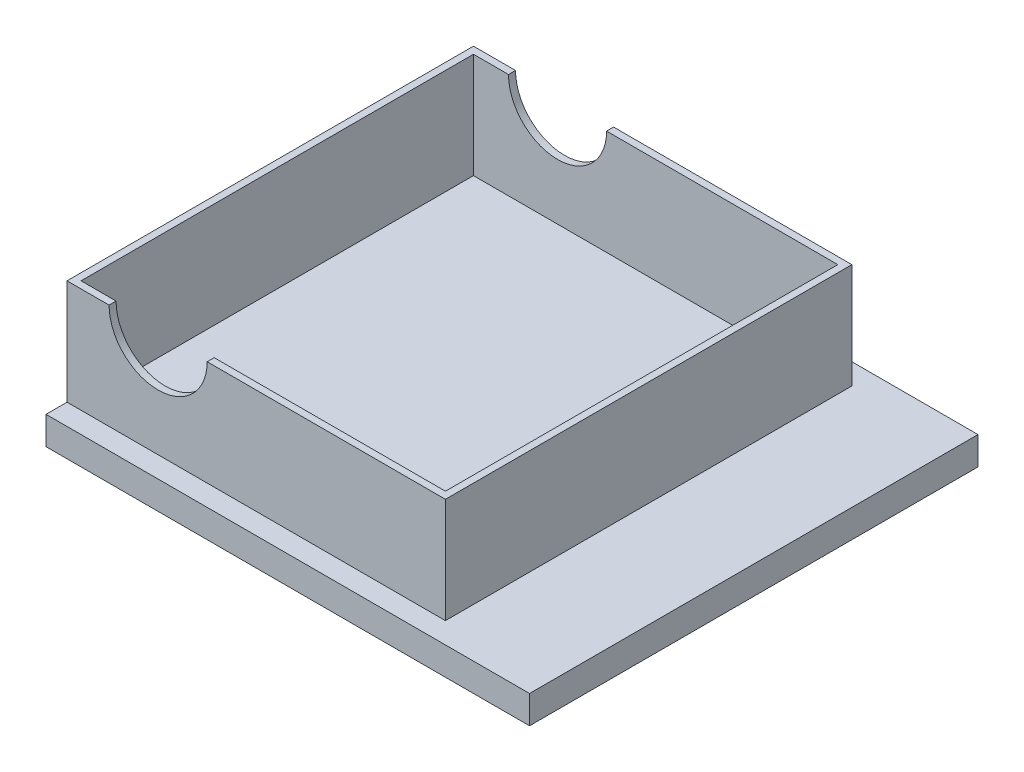
ISO-10303-21;
HEADER;
FILE_DESCRIPTION(('STEP AP214'),'2;1');
FILE_NAME('part.step','',(''),(''),'','','');
FILE_SCHEMA(('AUTOMOTIVE_DESIGN { 1 0 10303 214 1 1 1 1 }'));
ENDSEC;
DATA;
#1=APPLICATION_CONTEXT('core data for automotive mechanical design processes');
#2=APPLICATION_PROTOCOL_DEFINITION('international standard','automotive_design',2000,#1);
#3=PRODUCT_CONTEXT('',#1,'mechanical');
#4=PRODUCT('Part','Part','',(#3));
#5=PRODUCT_RELATED_PRODUCT_CATEGORY('part','',(#4));
#6=PRODUCT_DEFINITION_FORMATION('','',#4);
#7=PRODUCT_DEFINITION_CONTEXT('part definition',#1,'design');
#8=PRODUCT_DEFINITION('design','',#6,#7);
#9=PRODUCT_DEFINITION_SHAPE('','',#8);
#10=(LENGTH_UNIT() NAMED_UNIT(*) SI_UNIT(.MILLI.,.METRE.));
#11=(NAMED_UNIT(*) PLANE_ANGLE_UNIT() SI_UNIT($,.RADIAN.));
#12=(NAMED_UNIT(*) SI_UNIT($,.STERADIAN.) SOLID_ANGLE_UNIT());
#13=UNCERTAINTY_MEASURE_WITH_UNIT(LENGTH_MEASURE(1.E-05),#10,'distance_accuracy_value','');
#14=(GEOMETRIC_REPRESENTATION_CONTEXT(3) GLOBAL_UNCERTAINTY_ASSIGNED_CONTEXT((#13)) GLOBAL_UNIT_ASSIGNED_CONTEXT((#10,
#11,#12)) REPRESENTATION_CONTEXT('',''));
#15=CARTESIAN_POINT('',(0.,0.,0.));
#16=DIRECTION('',(0.,0.,1.));
#17=DIRECTION('',(1.,0.,0.));
#18=AXIS2_PLACEMENT_3D('',#15,#16,#17);
#19=CARTESIAN_POINT('',(0.,9.5,0.));
#20=DIRECTION('',(0.,1.,0.));
#21=DIRECTION('',(0.,0.,1.));
#22=AXIS2_PLACEMENT_3D('',#19,#20,#21);
#23=PLANE('',#22);
#24=DIRECTION('',(0.,0.,-1.));
#25=VECTOR('',#24,1.);
#26=CARTESIAN_POINT('',(-10.421052631579,9.5,-25.2894736842105));
#27=LINE('',#26,#25);
#28=CARTESIAN_POINT('',(-10.421052631579,9.5,-25.2894736842105));
#29=VERTEX_POINT('',#28);
#30=CARTESIAN_POINT('',(-10.421052631579,9.5,-25.7894736842105));
#31=VERTEX_POINT('',#30);
#32=EDGE_CURVE('E11',#29,#31,#27,.T.);
#33=ORIENTED_EDGE('',*,*,#32,.F.);
#34=DIRECTION('',(1.,0.,0.));
#35=VECTOR('',#34,1.);
#36=CARTESIAN_POINT('',(0.,9.5,-25.2894736842105));
#37=LINE('',#36,#35);
#38=CARTESIAN_POINT('',(6.07894736842105,9.5,-25.2894736842105));
#39=VERTEX_POINT('',#38);
#40=EDGE_CURVE('E176',#29,#39,#37,.T.);
#41=ORIENTED_EDGE('',*,*,#40,.T.);
#42=DIRECTION('',(0.,0.,1.));
#43=VECTOR('',#42,1.);
#44=CARTESIAN_POINT('',(6.07894736842105,9.5,0.));
#45=LINE('',#44,#43);
#46=CARTESIAN_POINT('',(6.07894736842105,9.5,2.71052631578947));
#47=VERTEX_POINT('',#46);
#48=EDGE_CURVE('E180',#39,#47,#45,.T.);
#49=ORIENTED_EDGE('',*,*,#48,.T.);
#50=DIRECTION('',(-1.,0.,0.));
#51=VECTOR('',#50,1.);
#52=CARTESIAN_POINT('',(0.,9.5,2.71052631578947));
#53=LINE('',#52,#51);
#54=CARTESIAN_POINT('',(-10.421052631579,9.5,2.71052631578947));
#55=VERTEX_POINT('',#54);
#56=EDGE_CURVE('E168',#47,#55,#53,.T.);
#57=ORIENTED_EDGE('',*,*,#56,.T.);
#58=DIRECTION('',(0.,0.,1.));
#59=VECTOR('',#58,1.);
#60=CARTESIAN_POINT('',(-10.421052631579,9.5,2.71052631578947));
#61=LINE('',#60,#59);
#62=CARTESIAN_POINT('',(-10.421052631579,9.5,3.21052631578947));
#63=VERTEX_POINT('',#62);
#64=EDGE_CURVE('E257',#63,#55,#61,.F.);
#65=ORIENTED_EDGE('',*,*,#64,.F.);
#66=DIRECTION('',(1.,0.,0.));
#67=VECTOR('',#66,1.);
#68=CARTESIAN_POINT('',(0.,9.5,3.21052631578947));
#69=LINE('',#68,#67);
#70=CARTESIAN_POINT('',(6.57894736842105,9.5,3.21052631578947));
#71=VERTEX_POINT('',#70);
#72=EDGE_CURVE('E287',#63,#71,#69,.T.);
#73=ORIENTED_EDGE('',*,*,#72,.T.);
#74=DIRECTION('',(0.,0.,-1.));
#75=VECTOR('',#74,1.);
#76=CARTESIAN_POINT('',(6.57894736842105,9.5,0.));
#77=LINE('',#76,#75);
#78=CARTESIAN_POINT('',(6.57894736842105,9.5,-25.7894736842105));
#79=VERTEX_POINT('',#78);
#80=EDGE_CURVE('E164',#71,#79,#77,.T.);
#81=ORIENTED_EDGE('',*,*,#80,.T.);
#82=DIRECTION('',(-1.,0.,0.));
#83=VECTOR('',#82,1.);
#84=CARTESIAN_POINT('',(0.,9.5,-25.7894736842105));
#85=LINE('',#84,#83);
#86=EDGE_CURVE('E159',#79,#31,#85,.T.);
#87=ORIENTED_EDGE('',*,*,#86,.T.);
#88=EDGE_LOOP('',(#33,#41,#49,#57,#65,#73,#81,#87));
#89=FACE_BOUND('',#88,.T.);
#90=ADVANCED_FACE('F39',(#89),#23,.T.);
#91=CARTESIAN_POINT('',(0.,2.,0.));
#92=DIRECTION('',(0.,1.,0.));
#93=DIRECTION('',(0.,0.,1.));
#94=AXIS2_PLACEMENT_3D('',#91,#92,#93);
#95=PLANE('',#94);
#96=DIRECTION('',(0.,0.,1.));
#97=VECTOR('',#96,1.);
#98=CARTESIAN_POINT('',(6.57894736842105,2.,0.));
#99=LINE('',#98,#97);
#100=CARTESIAN_POINT('',(6.57894736842105,2.,-25.7894736842105));
#101=VERTEX_POINT('',#100);
#102=CARTESIAN_POINT('',(6.57894736842105,2.,3.21052631578947));
#103=VERTEX_POINT('',#102);
#104=EDGE_CURVE('E209',#101,#103,#99,.T.);
#105=ORIENTED_EDGE('',*,*,#104,.T.);
#106=DIRECTION('',(-1.,0.,0.));
#107=VECTOR('',#106,1.);
#108=CARTESIAN_POINT('',(0.,2.,3.21052631578947));
#109=LINE('',#108,#107);
#110=CARTESIAN_POINT('',(-20.421052631579,2.,3.21052631578947));
#111=VERTEX_POINT('',#110);
#112=EDGE_CURVE('E212',#103,#111,#109,.T.);
#113=ORIENTED_EDGE('',*,*,#112,.T.);
#114=DIRECTION('',(0.,0.,-1.));
#115=VECTOR('',#114,1.);
#116=CARTESIAN_POINT('',(-20.4210526315789,2.,0.));
#117=LINE('',#116,#115);
#118=CARTESIAN_POINT('',(-20.421052631579,2.,4.71052631578947));
#119=VERTEX_POINT('',#118);
#120=EDGE_CURVE('E225',#119,#111,#117,.T.);
#121=ORIENTED_EDGE('',*,*,#120,.F.);
#122=DIRECTION('',(-1.,0.,0.));
#123=VECTOR('',#122,1.);
#124=CARTESIAN_POINT('',(0.,2.,4.71052631578947));
#125=LINE('',#124,#123);
#126=CARTESIAN_POINT('',(14.078947368421,2.,4.71052631578946));
#127=VERTEX_POINT('',#126);
#128=EDGE_CURVE('E228',#127,#119,#125,.T.);
#129=ORIENTED_EDGE('',*,*,#128,.F.);
#130=DIRECTION('',(0.,0.,1.));
#131=VECTOR('',#130,1.);
#132=CARTESIAN_POINT('',(14.078947368421,2.,0.));
#133=LINE('',#132,#131);
#134=CARTESIAN_POINT('',(14.078947368421,2.,-27.2894736842105));
#135=VERTEX_POINT('',#134);
#136=EDGE_CURVE('E232',#135,#127,#133,.T.);
#137=ORIENTED_EDGE('',*,*,#136,.F.);
#138=DIRECTION('',(1.,0.,0.));
#139=VECTOR('',#138,1.);
#140=CARTESIAN_POINT('',(0.,2.,-27.2894736842105));
#141=LINE('',#140,#139);
#142=CARTESIAN_POINT('',(-20.421052631579,2.,-27.2894736842105));
#143=VERTEX_POINT('',#142);
#144=EDGE_CURVE('E235',#143,#135,#141,.T.);
#145=ORIENTED_EDGE('',*,*,#144,.F.);
#146=CARTESIAN_POINT('',(-20.421052631579,2.,-25.7894736842105));
#147=VERTEX_POINT('',#146);
#148=EDGE_CURVE('E229',#147,#143,#117,.T.);
#149=ORIENTED_EDGE('',*,*,#148,.F.);
#150=DIRECTION('',(1.,0.,0.));
#151=VECTOR('',#150,1.);
#152=CARTESIAN_POINT('',(0.,2.,-25.7894736842105));
#153=LINE('',#152,#151);
#154=EDGE_CURVE('E206',#147,#101,#153,.T.);
#155=ORIENTED_EDGE('',*,*,#154,.T.);
#156=EDGE_LOOP('',(#105,#113,#121,#129,#137,#145,#149,#155));
#157=FACE_BOUND('',#156,.T.);
#158=ADVANCED_FACE('F304',(#157),#95,.T.);
#159=CARTESIAN_POINT('',(-20.4210526315789,2.,0.));
#160=DIRECTION('',(-1.,0.,0.));
#161=DIRECTION('',(0.,0.,1.));
#162=AXIS2_PLACEMENT_3D('',#159,#160,#161);
#163=PLANE('',#162);
#164=DIRECTION('',(0.,-1.,0.));
#165=VECTOR('',#164,1.);
#166=CARTESIAN_POINT('',(-20.421052631579,2.,-27.2894736842105));
#167=LINE('',#166,#165);
#168=CARTESIAN_POINT('',(-20.421052631579,0.,-27.2894736842105));
#169=VERTEX_POINT('',#168);
#170=EDGE_CURVE('E238',#143,#169,#167,.T.);
#171=ORIENTED_EDGE('',*,*,#170,.T.);
#172=DIRECTION('',(0.,0.,-1.));
#173=VECTOR('',#172,1.);
#174=CARTESIAN_POINT('',(-20.4210526315789,0.,0.));
#175=LINE('',#174,#173);
#176=CARTESIAN_POINT('',(-20.421052631579,0.,4.71052631578947));
#177=VERTEX_POINT('',#176);
#178=EDGE_CURVE('E224',#177,#169,#175,.T.);
#179=ORIENTED_EDGE('',*,*,#178,.F.);
#180=DIRECTION('',(0.,-1.,0.));
#181=VECTOR('',#180,1.);
#182=CARTESIAN_POINT('',(-20.421052631579,2.,4.71052631578947));
#183=LINE('',#182,#181);
#184=EDGE_CURVE('E255',#119,#177,#183,.T.);
#185=ORIENTED_EDGE('',*,*,#184,.F.);
#186=ORIENTED_EDGE('',*,*,#120,.T.);
#187=DIRECTION('',(0.,-1.,0.));
#188=VECTOR('',#187,1.);
#189=CARTESIAN_POINT('',(-20.421052631579,9.5,3.21052631578947));
#190=LINE('',#189,#188);
#191=CARTESIAN_POINT('',(-20.421052631579,9.5,3.21052631578947));
#192=VERTEX_POINT('',#191);
#193=EDGE_CURVE('E187',#192,#111,#190,.T.);
#194=ORIENTED_EDGE('',*,*,#193,.F.);
#195=DIRECTION('',(0.,0.,-1.));
#196=VECTOR('',#195,1.);
#197=CARTESIAN_POINT('',(-20.4210526315789,9.5,0.));
#198=LINE('',#197,#196);
#199=CARTESIAN_POINT('',(-20.421052631579,9.5,-25.7894736842105));
#200=VERTEX_POINT('',#199);
#201=EDGE_CURVE('E294',#192,#200,#198,.T.);
#202=ORIENTED_EDGE('',*,*,#201,.T.);
#203=DIRECTION('',(0.,-1.,0.));
#204=VECTOR('',#203,1.);
#205=CARTESIAN_POINT('',(-20.421052631579,9.5,-25.7894736842105));
#206=LINE('',#205,#204);
#207=EDGE_CURVE('E182',#200,#147,#206,.T.);
#208=ORIENTED_EDGE('',*,*,#207,.T.);
#209=ORIENTED_EDGE('',*,*,#148,.T.);
#210=EDGE_LOOP('',(#171,#179,#185,#186,#194,#202,#208,#209));
#211=FACE_BOUND('',#210,.T.);
#212=ADVANCED_FACE('F41',(#211),#163,.T.);
#213=CARTESIAN_POINT('',(0.,2.,4.71052631578947));
#214=DIRECTION('',(0.,0.,1.));
#215=DIRECTION('',(1.,0.,0.));
#216=AXIS2_PLACEMENT_3D('',#213,#214,#215);
#217=PLANE('',#216);
#218=DIRECTION('',(-1.,0.,0.));
#219=VECTOR('',#218,1.);
#220=CARTESIAN_POINT('',(0.,0.,4.71052631578947));
#221=LINE('',#220,#219);
#222=CARTESIAN_POINT('',(14.078947368421,0.,4.71052631578946));
#223=VERTEX_POINT('',#222);
#224=EDGE_CURVE('E240',#223,#177,#221,.T.);
#225=ORIENTED_EDGE('',*,*,#224,.F.);
#226=DIRECTION('',(0.,-1.,0.));
#227=VECTOR('',#226,1.);
#228=CARTESIAN_POINT('',(14.078947368421,2.,4.71052631578946));
#229=LINE('',#228,#227);
#230=EDGE_CURVE('E253',#127,#223,#229,.T.);
#231=ORIENTED_EDGE('',*,*,#230,.F.);
#232=ORIENTED_EDGE('',*,*,#128,.T.);
#233=ORIENTED_EDGE('',*,*,#184,.T.);
#234=EDGE_LOOP('',(#225,#231,#232,#233));
#235=FACE_BOUND('',#234,.T.);
#236=ADVANCED_FACE('F319',(#235),#217,.T.);
#237=CARTESIAN_POINT('',(14.078947368421,2.,0.));
#238=DIRECTION('',(1.,0.,0.));
#239=DIRECTION('',(0.,0.,-1.));
#240=AXIS2_PLACEMENT_3D('',#237,#238,#239);
#241=PLANE('',#240);
#242=DIRECTION('',(0.,0.,1.));
#243=VECTOR('',#242,1.);
#244=CARTESIAN_POINT('',(14.078947368421,0.,0.));
#245=LINE('',#244,#243);
#246=CARTESIAN_POINT('',(14.078947368421,0.,-27.2894736842105));
#247=VERTEX_POINT('',#246);
#248=EDGE_CURVE('E243',#247,#223,#245,.T.);
#249=ORIENTED_EDGE('',*,*,#248,.F.);
#250=DIRECTION('',(0.,-1.,0.));
#251=VECTOR('',#250,1.);
#252=CARTESIAN_POINT('',(14.078947368421,2.,-27.2894736842105));
#253=LINE('',#252,#251);
#254=EDGE_CURVE('E251',#135,#247,#253,.T.);
#255=ORIENTED_EDGE('',*,*,#254,.F.);
#256=ORIENTED_EDGE('',*,*,#136,.T.);
#257=ORIENTED_EDGE('',*,*,#230,.T.);
#258=EDGE_LOOP('',(#249,#255,#256,#257));
#259=FACE_BOUND('',#258,.T.);
#260=ADVANCED_FACE('F321',(#259),#241,.T.);
#261=CARTESIAN_POINT('',(0.,2.,-27.2894736842105));
#262=DIRECTION('',(0.,0.,-1.));
#263=DIRECTION('',(-1.,0.,0.));
#264=AXIS2_PLACEMENT_3D('',#261,#262,#263);
#265=PLANE('',#264);
#266=DIRECTION('',(1.,0.,0.));
#267=VECTOR('',#266,1.);
#268=CARTESIAN_POINT('',(0.,0.,-27.2894736842105));
#269=LINE('',#268,#267);
#270=EDGE_CURVE('E246',#169,#247,#269,.T.);
#271=ORIENTED_EDGE('',*,*,#270,.F.);
#272=ORIENTED_EDGE('',*,*,#170,.F.);
#273=ORIENTED_EDGE('',*,*,#144,.T.);
#274=ORIENTED_EDGE('',*,*,#254,.T.);
#275=EDGE_LOOP('',(#271,#272,#273,#274));
#276=FACE_BOUND('',#275,.T.);
#277=ADVANCED_FACE('F311',(#276),#265,.T.);
#278=CARTESIAN_POINT('',(0.,0.,0.));
#279=DIRECTION('',(0.,1.,0.));
#280=DIRECTION('',(0.,0.,1.));
#281=AXIS2_PLACEMENT_3D('',#278,#279,#280);
#282=PLANE('',#281);
#283=ORIENTED_EDGE('',*,*,#178,.T.);
#284=ORIENTED_EDGE('',*,*,#270,.T.);
#285=ORIENTED_EDGE('',*,*,#248,.T.);
#286=ORIENTED_EDGE('',*,*,#224,.T.);
#287=EDGE_LOOP('',(#283,#284,#285,#286));
#288=FACE_BOUND('',#287,.T.);
#289=ADVANCED_FACE('F314',(#288),#282,.F.);
#290=CARTESIAN_POINT('',(0.,9.5,2.71052631578947));
#291=DIRECTION('',(0.,0.,1.));
#292=DIRECTION('',(1.,0.,0.));
#293=AXIS2_PLACEMENT_3D('',#290,#291,#292);
#294=PLANE('',#293);
#295=CARTESIAN_POINT('',(-17.421052631579,9.5,2.71052631578947));
#296=VERTEX_POINT('',#295);
#297=CARTESIAN_POINT('',(-19.921052631579,9.5,2.71052631578947));
#298=VERTEX_POINT('',#297);
#299=EDGE_CURVE('E166',#296,#298,#53,.T.);
#300=ORIENTED_EDGE('',*,*,#299,.F.);
#301=CARTESIAN_POINT('',(-13.921052631579,9.5,2.71052631578947));
#302=DIRECTION('',(0.,0.,1.));
#303=DIRECTION('',(1.,0.,0.));
#304=AXIS2_PLACEMENT_3D('',#301,#302,#303);
#305=CIRCLE('',#304,3.5);
#306=EDGE_CURVE('E285',#296,#55,#305,.T.);
#307=ORIENTED_EDGE('',*,*,#306,.T.);
#308=ORIENTED_EDGE('',*,*,#56,.F.);
#309=DIRECTION('',(0.,-1.,0.));
#310=VECTOR('',#309,1.);
#311=CARTESIAN_POINT('',(6.07894736842105,9.5,2.71052631578947));
#312=LINE('',#311,#310);
#313=CARTESIAN_POINT('',(6.07894736842105,2.,2.71052631578947));
#314=VERTEX_POINT('',#313);
#315=EDGE_CURVE('E183',#47,#314,#312,.T.);
#316=ORIENTED_EDGE('',*,*,#315,.T.);
#317=DIRECTION('',(1.,0.,0.));
#318=VECTOR('',#317,1.);
#319=CARTESIAN_POINT('',(0.,2.,2.71052631578947));
#320=LINE('',#319,#318);
#321=CARTESIAN_POINT('',(-19.921052631579,2.,2.71052631578947));
#322=VERTEX_POINT('',#321);
#323=EDGE_CURVE('E221',#322,#314,#320,.T.);
#324=ORIENTED_EDGE('',*,*,#323,.F.);
#325=DIRECTION('',(0.,-1.,0.));
#326=VECTOR('',#325,1.);
#327=CARTESIAN_POINT('',(-19.921052631579,9.5,2.71052631578947));
#328=LINE('',#327,#326);
#329=EDGE_CURVE('E192',#298,#322,#328,.T.);
#330=ORIENTED_EDGE('',*,*,#329,.F.);
#331=EDGE_LOOP('',(#300,#307,#308,#316,#324,#330));
#332=FACE_BOUND('',#331,.T.);
#333=ADVANCED_FACE('F283',(#332),#294,.F.);
#334=CARTESIAN_POINT('',(-19.921052631579,9.5,0.));
#335=DIRECTION('',(-1.,0.,0.));
#336=DIRECTION('',(0.,0.,1.));
#337=AXIS2_PLACEMENT_3D('',#334,#335,#336);
#338=PLANE('',#337);
#339=DIRECTION('',(0.,0.,1.));
#340=VECTOR('',#339,1.);
#341=CARTESIAN_POINT('',(-19.921052631579,2.,0.));
#342=LINE('',#341,#340);
#343=CARTESIAN_POINT('',(-19.921052631579,2.,-25.2894736842105));
#344=VERTEX_POINT('',#343);
#345=EDGE_CURVE('E218',#344,#322,#342,.T.);
#346=ORIENTED_EDGE('',*,*,#345,.F.);
#347=DIRECTION('',(0.,-1.,0.));
#348=VECTOR('',#347,1.);
#349=CARTESIAN_POINT('',(-19.921052631579,9.5,-25.2894736842105));
#350=LINE('',#349,#348);
#351=CARTESIAN_POINT('',(-19.921052631579,9.5,-25.2894736842105));
#352=VERTEX_POINT('',#351);
#353=EDGE_CURVE('E189',#352,#344,#350,.T.);
#354=ORIENTED_EDGE('',*,*,#353,.F.);
#355=DIRECTION('',(0.,0.,-1.));
#356=VECTOR('',#355,1.);
#357=CARTESIAN_POINT('',(-19.921052631579,9.5,0.));
#358=LINE('',#357,#356);
#359=EDGE_CURVE('E174',#298,#352,#358,.T.);
#360=ORIENTED_EDGE('',*,*,#359,.F.);
#361=ORIENTED_EDGE('',*,*,#329,.T.);
#362=EDGE_LOOP('',(#346,#354,#360,#361));
#363=FACE_BOUND('',#362,.T.);
#364=ADVANCED_FACE('F273',(#363),#338,.F.);
#365=CARTESIAN_POINT('',(0.,9.5,-25.2894736842105));
#366=DIRECTION('',(0.,0.,-1.));
#367=DIRECTION('',(-1.,0.,0.));
#368=AXIS2_PLACEMENT_3D('',#365,#366,#367);
#369=PLANE('',#368);
#370=ORIENTED_EDGE('',*,*,#40,.F.);
#371=CARTESIAN_POINT('',(-13.921052631579,9.5,-25.2894736842105));
#372=DIRECTION('',(0.,0.,-1.));
#373=DIRECTION('',(-1.,0.,0.));
#374=AXIS2_PLACEMENT_3D('',#371,#372,#373);
#375=CIRCLE('',#374,3.5);
#376=CARTESIAN_POINT('',(-17.421052631579,9.5,-25.2894736842105));
#377=VERTEX_POINT('',#376);
#378=EDGE_CURVE('E151',#29,#377,#375,.T.);
#379=ORIENTED_EDGE('',*,*,#378,.T.);
#380=EDGE_CURVE('E177',#352,#377,#37,.T.);
#381=ORIENTED_EDGE('',*,*,#380,.F.);
#382=ORIENTED_EDGE('',*,*,#353,.T.);
#383=DIRECTION('',(-1.,0.,0.));
#384=VECTOR('',#383,1.);
#385=CARTESIAN_POINT('',(0.,2.,-25.2894736842105));
#386=LINE('',#385,#384);
#387=CARTESIAN_POINT('',(6.07894736842105,2.,-25.2894736842105));
#388=VERTEX_POINT('',#387);
#389=EDGE_CURVE('E215',#388,#344,#386,.T.);
#390=ORIENTED_EDGE('',*,*,#389,.F.);
#391=DIRECTION('',(0.,-1.,0.));
#392=VECTOR('',#391,1.);
#393=CARTESIAN_POINT('',(6.07894736842105,9.5,-25.2894736842105));
#394=LINE('',#393,#392);
#395=EDGE_CURVE('E186',#39,#388,#394,.T.);
#396=ORIENTED_EDGE('',*,*,#395,.F.);
#397=EDGE_LOOP('',(#370,#379,#381,#382,#390,#396));
#398=FACE_BOUND('',#397,.T.);
#399=ADVANCED_FACE('F263',(#398),#369,.F.);
#400=CARTESIAN_POINT('',(0.,9.5,3.21052631578947));
#401=DIRECTION('',(0.,0.,-1.));
#402=DIRECTION('',(-1.,0.,0.));
#403=AXIS2_PLACEMENT_3D('',#400,#401,#402);
#404=PLANE('',#403);
#405=ORIENTED_EDGE('',*,*,#72,.F.);
#406=CARTESIAN_POINT('',(-13.921052631579,9.5,3.21052631578947));
#407=DIRECTION('',(0.,0.,1.));
#408=DIRECTION('',(1.,0.,0.));
#409=AXIS2_PLACEMENT_3D('',#406,#407,#408);
#410=CIRCLE('',#409,3.5);
#411=CARTESIAN_POINT('',(-17.421052631579,9.5,3.21052631578947));
#412=VERTEX_POINT('',#411);
#413=EDGE_CURVE('E61',#412,#63,#410,.T.);
#414=ORIENTED_EDGE('',*,*,#413,.F.);
#415=EDGE_CURVE('E293',#192,#412,#69,.T.);
#416=ORIENTED_EDGE('',*,*,#415,.F.);
#417=ORIENTED_EDGE('',*,*,#193,.T.);
#418=ORIENTED_EDGE('',*,*,#112,.F.);
#419=DIRECTION('',(0.,-1.,0.));
#420=VECTOR('',#419,1.);
#421=CARTESIAN_POINT('',(6.57894736842105,9.5,3.21052631578947));
#422=LINE('',#421,#420);
#423=EDGE_CURVE('E200',#71,#103,#422,.T.);
#424=ORIENTED_EDGE('',*,*,#423,.F.);
#425=EDGE_LOOP('',(#405,#414,#416,#417,#418,#424));
#426=FACE_BOUND('',#425,.T.);
#427=ADVANCED_FACE('F290',(#426),#404,.F.);
#428=CARTESIAN_POINT('',(6.57894736842105,9.5,0.));
#429=DIRECTION('',(-1.,0.,0.));
#430=DIRECTION('',(0.,0.,1.));
#431=AXIS2_PLACEMENT_3D('',#428,#429,#430);
#432=PLANE('',#431);
#433=ORIENTED_EDGE('',*,*,#104,.F.);
#434=DIRECTION('',(0.,-1.,0.));
#435=VECTOR('',#434,1.);
#436=CARTESIAN_POINT('',(6.57894736842105,9.5,-25.7894736842105));
#437=LINE('',#436,#435);
#438=EDGE_CURVE('E198',#79,#101,#437,.T.);
#439=ORIENTED_EDGE('',*,*,#438,.F.);
#440=ORIENTED_EDGE('',*,*,#80,.F.);
#441=ORIENTED_EDGE('',*,*,#423,.T.);
#442=EDGE_LOOP('',(#433,#439,#440,#441));
#443=FACE_BOUND('',#442,.T.);
#444=ADVANCED_FACE('F346',(#443),#432,.F.);
#445=CARTESIAN_POINT('',(0.,9.5,-25.7894736842105));
#446=DIRECTION('',(0.,0.,1.));
#447=DIRECTION('',(1.,0.,0.));
#448=AXIS2_PLACEMENT_3D('',#445,#446,#447);
#449=PLANE('',#448);
#450=CARTESIAN_POINT('',(-17.421052631579,9.5,-25.7894736842105));
#451=VERTEX_POINT('',#450);
#452=EDGE_CURVE('E161',#451,#200,#85,.T.);
#453=ORIENTED_EDGE('',*,*,#452,.F.);
#454=CARTESIAN_POINT('',(-13.921052631579,9.5,-25.7894736842105));
#455=DIRECTION('',(0.,0.,-1.));
#456=DIRECTION('',(-1.,0.,0.));
#457=AXIS2_PLACEMENT_3D('',#454,#455,#456);
#458=CIRCLE('',#457,3.5);
#459=EDGE_CURVE('E53',#31,#451,#458,.T.);
#460=ORIENTED_EDGE('',*,*,#459,.F.);
#461=ORIENTED_EDGE('',*,*,#86,.F.);
#462=ORIENTED_EDGE('',*,*,#438,.T.);
#463=ORIENTED_EDGE('',*,*,#154,.F.);
#464=ORIENTED_EDGE('',*,*,#207,.F.);
#465=EDGE_LOOP('',(#453,#460,#461,#462,#463,#464));
#466=FACE_BOUND('',#465,.T.);
#467=ADVANCED_FACE('F158',(#466),#449,.F.);
#468=CARTESIAN_POINT('',(6.07894736842105,9.5,0.));
#469=DIRECTION('',(1.,0.,0.));
#470=DIRECTION('',(0.,0.,-1.));
#471=AXIS2_PLACEMENT_3D('',#468,#469,#470);
#472=PLANE('',#471);
#473=DIRECTION('',(0.,0.,-1.));
#474=VECTOR('',#473,1.);
#475=CARTESIAN_POINT('',(6.07894736842105,2.,0.));
#476=LINE('',#475,#474);
#477=EDGE_CURVE('E195',#314,#388,#476,.T.);
#478=ORIENTED_EDGE('',*,*,#477,.F.);
#479=ORIENTED_EDGE('',*,*,#315,.F.);
#480=ORIENTED_EDGE('',*,*,#48,.F.);
#481=ORIENTED_EDGE('',*,*,#395,.T.);
#482=EDGE_LOOP('',(#478,#479,#480,#481));
#483=FACE_BOUND('',#482,.T.);
#484=ADVANCED_FACE('F279',(#483),#472,.F.);
#485=DIRECTION('',(0.,0.,-1.));
#486=VECTOR('',#485,1.);
#487=CARTESIAN_POINT('',(-17.421052631579,9.5,-25.2894736842105));
#488=LINE('',#487,#486);
#489=EDGE_CURVE('E47',#451,#377,#488,.F.);
#490=ORIENTED_EDGE('',*,*,#489,.F.);
#491=ORIENTED_EDGE('',*,*,#452,.T.);
#492=ORIENTED_EDGE('',*,*,#201,.F.);
#493=ORIENTED_EDGE('',*,*,#415,.T.);
#494=DIRECTION('',(0.,0.,1.));
#495=VECTOR('',#494,1.);
#496=CARTESIAN_POINT('',(-17.421052631579,9.5,2.71052631578947));
#497=LINE('',#496,#495);
#498=EDGE_CURVE('E259',#296,#412,#497,.T.);
#499=ORIENTED_EDGE('',*,*,#498,.F.);
#500=ORIENTED_EDGE('',*,*,#299,.T.);
#501=ORIENTED_EDGE('',*,*,#359,.T.);
#502=ORIENTED_EDGE('',*,*,#380,.T.);
#503=EDGE_LOOP('',(#490,#491,#492,#493,#499,#500,#501,#502));
#504=FACE_BOUND('',#503,.T.);
#505=ADVANCED_FACE('F266',(#504),#23,.T.);
#506=ORIENTED_EDGE('',*,*,#345,.T.);
#507=ORIENTED_EDGE('',*,*,#323,.T.);
#508=ORIENTED_EDGE('',*,*,#477,.T.);
#509=ORIENTED_EDGE('',*,*,#389,.T.);
#510=EDGE_LOOP('',(#506,#507,#508,#509));
#511=FACE_BOUND('',#510,.T.);
#512=ADVANCED_FACE('F276',(#511),#95,.T.);
#513=CARTESIAN_POINT('',(-13.921052631579,9.5,2.71052631578947));
#514=DIRECTION('',(0.,0.,1.));
#515=DIRECTION('',(1.,0.,0.));
#516=AXIS2_PLACEMENT_3D('',#513,#514,#515);
#517=CYLINDRICAL_SURFACE('',#516,3.5);
#518=ORIENTED_EDGE('',*,*,#498,.T.);
#519=ORIENTED_EDGE('',*,*,#413,.T.);
#520=ORIENTED_EDGE('',*,*,#64,.T.);
#521=ORIENTED_EDGE('',*,*,#306,.F.);
#522=EDGE_LOOP('',(#518,#519,#520,#521));
#523=FACE_BOUND('',#522,.T.);
#524=ADVANCED_FACE('F342',(#523),#517,.F.);
#525=CARTESIAN_POINT('',(-13.921052631579,9.5,-25.2894736842105));
#526=DIRECTION('',(0.,0.,-1.));
#527=DIRECTION('',(-1.,0.,0.));
#528=AXIS2_PLACEMENT_3D('',#525,#526,#527);
#529=CYLINDRICAL_SURFACE('',#528,3.5);
#530=ORIENTED_EDGE('',*,*,#32,.T.);
#531=ORIENTED_EDGE('',*,*,#459,.T.);
#532=ORIENTED_EDGE('',*,*,#489,.T.);
#533=ORIENTED_EDGE('',*,*,#378,.F.);
#534=EDGE_LOOP('',(#530,#531,#532,#533));
#535=FACE_BOUND('',#534,.T.);
#536=ADVANCED_FACE('F149',(#535),#529,.F.);
#537=CLOSED_SHELL('',(#90,#158,#212,#236,#260,#277,#289,#333,#364,#399,#427,#444,#467,#484,#505,
#512,#524,#536));
#538=MANIFOLD_SOLID_BREP('B2',#537);
#539=ADVANCED_BREP_SHAPE_REPRESENTATION('',(#18,#538),#14);
#540=SHAPE_DEFINITION_REPRESENTATION(#9,#539);
ENDSEC;
END-ISO-10303-21;
